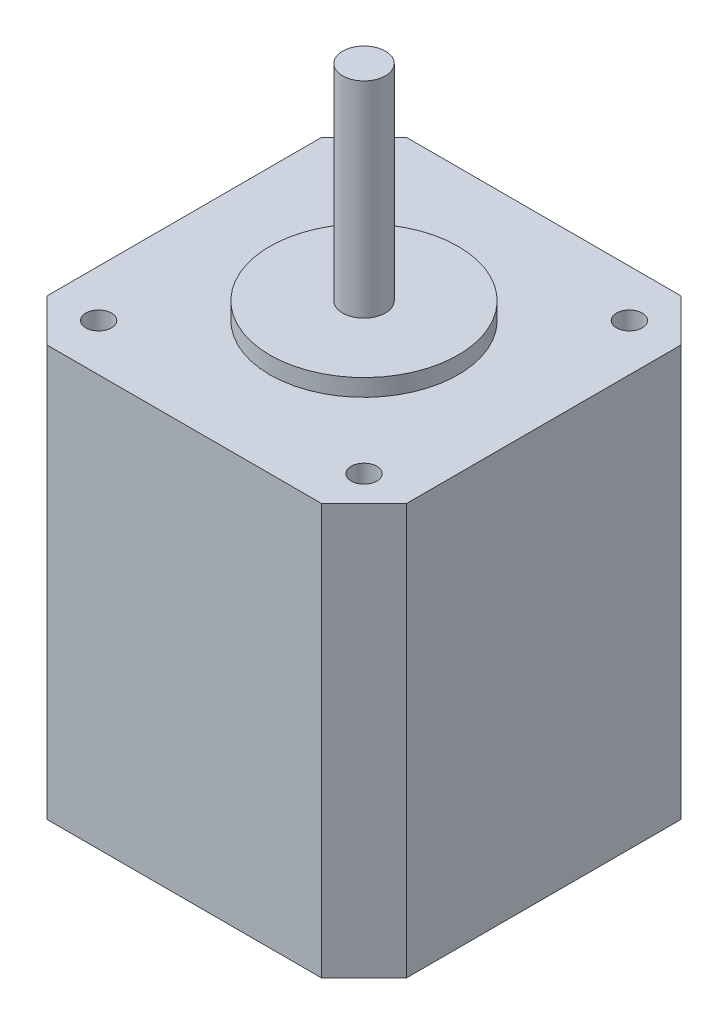
ISO-10303-21;
HEADER;
FILE_DESCRIPTION(('STEP AP214'),'2;1');
FILE_NAME('part.step','',(''),(''),'','','');
FILE_SCHEMA(('AUTOMOTIVE_DESIGN { 1 0 10303 214 1 1 1 1 }'));
ENDSEC;
DATA;
#1=APPLICATION_CONTEXT('core data for automotive mechanical design processes');
#2=APPLICATION_PROTOCOL_DEFINITION('international standard','automotive_design',2000,#1);
#3=PRODUCT_CONTEXT('',#1,'mechanical');
#4=PRODUCT('Part','Part','',(#3));
#5=PRODUCT_RELATED_PRODUCT_CATEGORY('part','',(#4));
#6=PRODUCT_DEFINITION_FORMATION('','',#4);
#7=PRODUCT_DEFINITION_CONTEXT('part definition',#1,'design');
#8=PRODUCT_DEFINITION('design','',#6,#7);
#9=PRODUCT_DEFINITION_SHAPE('','',#8);
#10=(LENGTH_UNIT() NAMED_UNIT(*) SI_UNIT(.MILLI.,.METRE.));
#11=(NAMED_UNIT(*) PLANE_ANGLE_UNIT() SI_UNIT($,.RADIAN.));
#12=(NAMED_UNIT(*) SI_UNIT($,.STERADIAN.) SOLID_ANGLE_UNIT());
#13=UNCERTAINTY_MEASURE_WITH_UNIT(LENGTH_MEASURE(1.E-05),#10,'distance_accuracy_value','');
#14=(GEOMETRIC_REPRESENTATION_CONTEXT(3) GLOBAL_UNCERTAINTY_ASSIGNED_CONTEXT((#13)) GLOBAL_UNIT_ASSIGNED_CONTEXT((#10,
#11,#12)) REPRESENTATION_CONTEXT('',''));
#15=CARTESIAN_POINT('',(0.,0.,0.));
#16=DIRECTION('',(0.,0.,1.));
#17=DIRECTION('',(1.,0.,0.));
#18=AXIS2_PLACEMENT_3D('',#15,#16,#17);
#19=CARTESIAN_POINT('',(0.,48.,0.));
#20=DIRECTION('',(1.,0.,0.));
#21=DIRECTION('',(0.,0.,-1.));
#22=AXIS2_PLACEMENT_3D('',#19,#20,#21);
#23=PLANE('',#22);
#24=DIRECTION('',(0.,0.,1.));
#25=VECTOR('',#24,1.);
#26=CARTESIAN_POINT('',(0.,48.,0.));
#27=LINE('',#26,#25);
#28=CARTESIAN_POINT('',(0.,48.,-37.0502525316942));
#29=VERTEX_POINT('',#28);
#30=CARTESIAN_POINT('',(0.,48.,-4.94974746830583));
#31=VERTEX_POINT('',#30);
#32=EDGE_CURVE('E120',#29,#31,#27,.T.);
#33=ORIENTED_EDGE('',*,*,#32,.F.);
#34=DIRECTION('',(0.,1.,0.));
#35=VECTOR('',#34,1.);
#36=CARTESIAN_POINT('',(0.,0.,-37.0502525316942));
#37=LINE('',#36,#35);
#38=CARTESIAN_POINT('',(0.,0.,-37.0502525316942));
#39=VERTEX_POINT('',#38);
#40=EDGE_CURVE('E177',#39,#29,#37,.T.);
#41=ORIENTED_EDGE('',*,*,#40,.F.);
#42=DIRECTION('',(0.,0.,1.));
#43=VECTOR('',#42,1.);
#44=CARTESIAN_POINT('',(0.,0.,0.));
#45=LINE('',#44,#43);
#46=CARTESIAN_POINT('',(0.,0.,-4.94974746830583));
#47=VERTEX_POINT('',#46);
#48=EDGE_CURVE('E121',#39,#47,#45,.T.);
#49=ORIENTED_EDGE('',*,*,#48,.T.);
#50=DIRECTION('',(0.,1.,0.));
#51=VECTOR('',#50,1.);
#52=CARTESIAN_POINT('',(0.,0.,-4.94974746830583));
#53=LINE('',#52,#51);
#54=EDGE_CURVE('E165',#47,#31,#53,.T.);
#55=ORIENTED_EDGE('',*,*,#54,.T.);
#56=EDGE_LOOP('',(#33,#41,#49,#55));
#57=FACE_BOUND('',#56,.T.);
#58=ADVANCED_FACE('F32',(#57),#23,.F.);
#59=CARTESIAN_POINT('',(0.,48.,0.));
#60=DIRECTION('',(0.,0.,-1.));
#61=DIRECTION('',(-1.,0.,0.));
#62=AXIS2_PLACEMENT_3D('',#59,#60,#61);
#63=PLANE('',#62);
#64=DIRECTION('',(1.,0.,0.));
#65=VECTOR('',#64,1.);
#66=CARTESIAN_POINT('',(0.,0.,0.));
#67=LINE('',#66,#65);
#68=CARTESIAN_POINT('',(4.94974746830583,0.,0.));
#69=VERTEX_POINT('',#68);
#70=CARTESIAN_POINT('',(37.0502525316942,0.,0.));
#71=VERTEX_POINT('',#70);
#72=EDGE_CURVE('E118',#69,#71,#67,.T.);
#73=ORIENTED_EDGE('',*,*,#72,.T.);
#74=DIRECTION('',(0.,1.,0.));
#75=VECTOR('',#74,1.);
#76=CARTESIAN_POINT('',(37.0502525316942,0.,0.));
#77=LINE('',#76,#75);
#78=CARTESIAN_POINT('',(37.0502525316942,48.,0.));
#79=VERTEX_POINT('',#78);
#80=EDGE_CURVE('E48',#71,#79,#77,.T.);
#81=ORIENTED_EDGE('',*,*,#80,.T.);
#82=DIRECTION('',(1.,0.,0.));
#83=VECTOR('',#82,1.);
#84=CARTESIAN_POINT('',(0.,48.,0.));
#85=LINE('',#84,#83);
#86=CARTESIAN_POINT('',(4.94974746830583,48.,0.));
#87=VERTEX_POINT('',#86);
#88=EDGE_CURVE('E131',#87,#79,#85,.T.);
#89=ORIENTED_EDGE('',*,*,#88,.F.);
#90=DIRECTION('',(0.,1.,0.));
#91=VECTOR('',#90,1.);
#92=CARTESIAN_POINT('',(4.94974746830583,0.,0.));
#93=LINE('',#92,#91);
#94=EDGE_CURVE('E168',#69,#87,#93,.T.);
#95=ORIENTED_EDGE('',*,*,#94,.F.);
#96=EDGE_LOOP('',(#73,#81,#89,#95));
#97=FACE_BOUND('',#96,.T.);
#98=ADVANCED_FACE('F196',(#97),#63,.F.);
#99=CARTESIAN_POINT('',(42.,48.,0.));
#100=DIRECTION('',(-1.,0.,0.));
#101=DIRECTION('',(0.,0.,1.));
#102=AXIS2_PLACEMENT_3D('',#99,#100,#101);
#103=PLANE('',#102);
#104=DIRECTION('',(0.,0.,-1.));
#105=VECTOR('',#104,1.);
#106=CARTESIAN_POINT('',(42.,0.,0.));
#107=LINE('',#106,#105);
#108=CARTESIAN_POINT('',(42.,0.,-4.94974746830583));
#109=VERTEX_POINT('',#108);
#110=CARTESIAN_POINT('',(42.,0.,-37.0502525316942));
#111=VERTEX_POINT('',#110);
#112=EDGE_CURVE('E110',#109,#111,#107,.T.);
#113=ORIENTED_EDGE('',*,*,#112,.T.);
#114=DIRECTION('',(0.,1.,0.));
#115=VECTOR('',#114,1.);
#116=CARTESIAN_POINT('',(42.,0.,-37.0502525316942));
#117=LINE('',#116,#115);
#118=CARTESIAN_POINT('',(42.,48.,-37.0502525316942));
#119=VERTEX_POINT('',#118);
#120=EDGE_CURVE('E56',#111,#119,#117,.T.);
#121=ORIENTED_EDGE('',*,*,#120,.T.);
#122=DIRECTION('',(0.,0.,-1.));
#123=VECTOR('',#122,1.);
#124=CARTESIAN_POINT('',(42.,48.,0.));
#125=LINE('',#124,#123);
#126=CARTESIAN_POINT('',(42.,48.,-4.94974746830583));
#127=VERTEX_POINT('',#126);
#128=EDGE_CURVE('E112',#127,#119,#125,.T.);
#129=ORIENTED_EDGE('',*,*,#128,.F.);
#130=DIRECTION('',(0.,1.,0.));
#131=VECTOR('',#130,1.);
#132=CARTESIAN_POINT('',(42.,0.,-4.94974746830583));
#133=LINE('',#132,#131);
#134=EDGE_CURVE('E98',#109,#127,#133,.T.);
#135=ORIENTED_EDGE('',*,*,#134,.F.);
#136=EDGE_LOOP('',(#113,#121,#129,#135));
#137=FACE_BOUND('',#136,.T.);
#138=ADVANCED_FACE('F109',(#137),#103,.F.);
#139=CARTESIAN_POINT('',(0.,48.,-42.));
#140=DIRECTION('',(0.,0.,1.));
#141=DIRECTION('',(1.,0.,0.));
#142=AXIS2_PLACEMENT_3D('',#139,#140,#141);
#143=PLANE('',#142);
#144=DIRECTION('',(-1.,0.,0.));
#145=VECTOR('',#144,1.);
#146=CARTESIAN_POINT('',(0.,0.,-42.));
#147=LINE('',#146,#145);
#148=CARTESIAN_POINT('',(37.0502525316942,0.,-42.));
#149=VERTEX_POINT('',#148);
#150=CARTESIAN_POINT('',(4.94974746830584,0.,-42.));
#151=VERTEX_POINT('',#150);
#152=EDGE_CURVE('E35',#149,#151,#147,.T.);
#153=ORIENTED_EDGE('',*,*,#152,.T.);
#154=DIRECTION('',(0.,1.,0.));
#155=VECTOR('',#154,1.);
#156=CARTESIAN_POINT('',(4.94974746830583,0.,-42.));
#157=LINE('',#156,#155);
#158=CARTESIAN_POINT('',(4.94974746830583,48.,-42.));
#159=VERTEX_POINT('',#158);
#160=EDGE_CURVE('E179',#151,#159,#157,.T.);
#161=ORIENTED_EDGE('',*,*,#160,.T.);
#162=DIRECTION('',(-1.,0.,0.));
#163=VECTOR('',#162,1.);
#164=CARTESIAN_POINT('',(0.,48.,-42.));
#165=LINE('',#164,#163);
#166=CARTESIAN_POINT('',(37.0502525316942,48.,-42.));
#167=VERTEX_POINT('',#166);
#168=EDGE_CURVE('E127',#167,#159,#165,.T.);
#169=ORIENTED_EDGE('',*,*,#168,.F.);
#170=DIRECTION('',(0.,1.,0.));
#171=VECTOR('',#170,1.);
#172=CARTESIAN_POINT('',(37.0502525316942,0.,-42.));
#173=LINE('',#172,#171);
#174=EDGE_CURVE('E187',#149,#167,#173,.T.);
#175=ORIENTED_EDGE('',*,*,#174,.F.);
#176=EDGE_LOOP('',(#153,#161,#169,#175));
#177=FACE_BOUND('',#176,.T.);
#178=ADVANCED_FACE('F210',(#177),#143,.F.);
#179=CARTESIAN_POINT('',(0.,48.,0.));
#180=DIRECTION('',(0.,-1.,0.));
#181=DIRECTION('',(0.,0.,-1.));
#182=AXIS2_PLACEMENT_3D('',#179,#180,#181);
#183=PLANE('',#182);
#184=CARTESIAN_POINT('',(36.5,48.,-36.5));
#185=DIRECTION('',(0.,1.,0.));
#186=DIRECTION('',(0.,0.,-1.));
#187=AXIS2_PLACEMENT_3D('',#184,#185,#186);
#188=CIRCLE('',#187,1.5);
#189=CARTESIAN_POINT('',(36.5,48.,-38.));
#190=VERTEX_POINT('',#189);
#191=EDGE_CURVE('E157',#190,#190,#188,.T.);
#192=ORIENTED_EDGE('',*,*,#191,.F.);
#193=EDGE_LOOP('',(#192));
#194=FACE_BOUND('',#193,.T.);
#195=CARTESIAN_POINT('',(5.49999999999998,48.,-5.50000000000004));
#196=DIRECTION('',(0.,1.,0.));
#197=DIRECTION('',(0.,0.,-1.));
#198=AXIS2_PLACEMENT_3D('',#195,#196,#197);
#199=CIRCLE('',#198,1.5);
#200=CARTESIAN_POINT('',(5.49999999999998,48.,-7.00000000000005));
#201=VERTEX_POINT('',#200);
#202=EDGE_CURVE('E150',#201,#201,#199,.T.);
#203=ORIENTED_EDGE('',*,*,#202,.F.);
#204=EDGE_LOOP('',(#203));
#205=FACE_BOUND('',#204,.T.);
#206=CARTESIAN_POINT('',(5.49999999999999,48.,-36.5));
#207=DIRECTION('',(0.,1.,0.));
#208=DIRECTION('',(0.,0.,1.));
#209=AXIS2_PLACEMENT_3D('',#206,#207,#208);
#210=CIRCLE('',#209,1.50000000000001);
#211=CARTESIAN_POINT('',(5.49999999999999,48.,-35.));
#212=VERTEX_POINT('',#211);
#213=EDGE_CURVE('E162',#212,#212,#210,.T.);
#214=ORIENTED_EDGE('',*,*,#213,.F.);
#215=EDGE_LOOP('',(#214));
#216=FACE_BOUND('',#215,.T.);
#217=CARTESIAN_POINT('',(36.5,48.,-5.5));
#218=DIRECTION('',(0.,1.,0.));
#219=DIRECTION('',(0.,0.,1.));
#220=AXIS2_PLACEMENT_3D('',#217,#218,#219);
#221=CIRCLE('',#220,1.5);
#222=CARTESIAN_POINT('',(36.5,48.,-4.));
#223=VERTEX_POINT('',#222);
#224=EDGE_CURVE('E144',#223,#223,#221,.T.);
#225=ORIENTED_EDGE('',*,*,#224,.F.);
#226=EDGE_LOOP('',(#225));
#227=FACE_BOUND('',#226,.T.);
#228=CARTESIAN_POINT('',(21.,48.,-21.));
#229=DIRECTION('',(0.,1.,0.));
#230=DIRECTION('',(0.,0.,1.));
#231=AXIS2_PLACEMENT_3D('',#228,#229,#230);
#232=CIRCLE('',#231,11.);
#233=CARTESIAN_POINT('',(21.,48.,-10.));
#234=VERTEX_POINT('',#233);
#235=EDGE_CURVE('E40',#234,#234,#232,.T.);
#236=ORIENTED_EDGE('',*,*,#235,.F.);
#237=EDGE_LOOP('',(#236));
#238=FACE_BOUND('',#237,.T.);
#239=ORIENTED_EDGE('',*,*,#168,.T.);
#240=DIRECTION('',(0.707106781186548,0.,-0.707106781186547));
#241=VECTOR('',#240,1.);
#242=CARTESIAN_POINT('',(0.,48.,-37.0502525316942));
#243=LINE('',#242,#241);
#244=EDGE_CURVE('E184',#29,#159,#243,.T.);
#245=ORIENTED_EDGE('',*,*,#244,.F.);
#246=ORIENTED_EDGE('',*,*,#32,.T.);
#247=DIRECTION('',(-0.707106781186548,0.,-0.707106781186548));
#248=VECTOR('',#247,1.);
#249=CARTESIAN_POINT('',(0.,48.,-4.94974746830583));
#250=LINE('',#249,#248);
#251=EDGE_CURVE('E173',#87,#31,#250,.T.);
#252=ORIENTED_EDGE('',*,*,#251,.F.);
#253=ORIENTED_EDGE('',*,*,#88,.T.);
#254=DIRECTION('',(-0.707106781186547,0.,0.707106781186548));
#255=VECTOR('',#254,1.);
#256=CARTESIAN_POINT('',(37.0502525316942,48.,0.));
#257=LINE('',#256,#255);
#258=EDGE_CURVE('E104',#127,#79,#257,.T.);
#259=ORIENTED_EDGE('',*,*,#258,.F.);
#260=ORIENTED_EDGE('',*,*,#128,.T.);
#261=DIRECTION('',(0.707106781186547,0.,0.707106781186547));
#262=VECTOR('',#261,1.);
#263=CARTESIAN_POINT('',(37.0502525316942,48.,-42.));
#264=LINE('',#263,#262);
#265=EDGE_CURVE('E183',#167,#119,#264,.T.);
#266=ORIENTED_EDGE('',*,*,#265,.F.);
#267=EDGE_LOOP('',(#239,#245,#246,#252,#253,#259,#260,#266));
#268=FACE_BOUND('',#267,.T.);
#269=ADVANCED_FACE('F199',(#194,#205,#216,#227,#238,#268),#183,.F.);
#270=CARTESIAN_POINT('',(0.,0.,0.));
#271=DIRECTION('',(0.,-1.,0.));
#272=DIRECTION('',(0.,0.,-1.));
#273=AXIS2_PLACEMENT_3D('',#270,#271,#272);
#274=PLANE('',#273);
#275=DIRECTION('',(0.707106781186548,0.,-0.707106781186547));
#276=VECTOR('',#275,1.);
#277=CARTESIAN_POINT('',(0.,0.,-37.0502525316942));
#278=LINE('',#277,#276);
#279=EDGE_CURVE('E180',#39,#151,#278,.T.);
#280=ORIENTED_EDGE('',*,*,#279,.T.);
#281=ORIENTED_EDGE('',*,*,#152,.F.);
#282=DIRECTION('',(0.707106781186547,0.,0.707106781186547));
#283=VECTOR('',#282,1.);
#284=CARTESIAN_POINT('',(37.0502525316942,0.,-42.));
#285=LINE('',#284,#283);
#286=EDGE_CURVE('E117',#149,#111,#285,.T.);
#287=ORIENTED_EDGE('',*,*,#286,.T.);
#288=ORIENTED_EDGE('',*,*,#112,.F.);
#289=DIRECTION('',(-0.707106781186547,0.,0.707106781186548));
#290=VECTOR('',#289,1.);
#291=CARTESIAN_POINT('',(37.0502525316942,0.,0.));
#292=LINE('',#291,#290);
#293=EDGE_CURVE('E95',#109,#71,#292,.T.);
#294=ORIENTED_EDGE('',*,*,#293,.T.);
#295=ORIENTED_EDGE('',*,*,#72,.F.);
#296=DIRECTION('',(-0.707106781186548,0.,-0.707106781186548));
#297=VECTOR('',#296,1.);
#298=CARTESIAN_POINT('',(0.,0.,-4.94974746830583));
#299=LINE('',#298,#297);
#300=EDGE_CURVE('E170',#69,#47,#299,.T.);
#301=ORIENTED_EDGE('',*,*,#300,.T.);
#302=ORIENTED_EDGE('',*,*,#48,.F.);
#303=EDGE_LOOP('',(#280,#281,#287,#288,#294,#295,#301,#302));
#304=FACE_BOUND('',#303,.T.);
#305=ADVANCED_FACE('F115',(#304),#274,.T.);
#306=CARTESIAN_POINT('',(21.,50.,-21.));
#307=DIRECTION('',(0.,-1.,0.));
#308=DIRECTION('',(0.,0.,-1.));
#309=AXIS2_PLACEMENT_3D('',#306,#307,#308);
#310=CYLINDRICAL_SURFACE('',#309,11.);
#311=CARTESIAN_POINT('',(21.,50.,-21.));
#312=DIRECTION('',(0.,1.,0.));
#313=DIRECTION('',(0.,0.,1.));
#314=AXIS2_PLACEMENT_3D('',#311,#312,#313);
#315=CIRCLE('',#314,11.);
#316=CARTESIAN_POINT('',(21.,50.,-10.));
#317=VERTEX_POINT('',#316);
#318=EDGE_CURVE('E126',#317,#317,#315,.T.);
#319=ORIENTED_EDGE('',*,*,#318,.F.);
#320=EDGE_LOOP('',(#319));
#321=FACE_BOUND('',#320,.T.);
#322=ORIENTED_EDGE('',*,*,#235,.T.);
#323=EDGE_LOOP('',(#322));
#324=FACE_BOUND('',#323,.T.);
#325=ADVANCED_FACE('F236',(#321,#324),#310,.T.);
#326=CARTESIAN_POINT('',(21.,50.,-21.));
#327=DIRECTION('',(0.,1.,0.));
#328=DIRECTION('',(0.,0.,1.));
#329=AXIS2_PLACEMENT_3D('',#326,#327,#328);
#330=PLANE('',#329);
#331=CARTESIAN_POINT('',(21.,50.,-21.));
#332=DIRECTION('',(0.,1.,0.));
#333=DIRECTION('',(0.,0.,1.));
#334=AXIS2_PLACEMENT_3D('',#331,#332,#333);
#335=CIRCLE('',#334,2.5);
#336=CARTESIAN_POINT('',(21.,50.,-18.5));
#337=VERTEX_POINT('',#336);
#338=EDGE_CURVE('E11',#337,#337,#335,.T.);
#339=ORIENTED_EDGE('',*,*,#338,.F.);
#340=EDGE_LOOP('',(#339));
#341=FACE_BOUND('',#340,.T.);
#342=ORIENTED_EDGE('',*,*,#318,.T.);
#343=EDGE_LOOP('',(#342));
#344=FACE_BOUND('',#343,.T.);
#345=ADVANCED_FACE('F242',(#341,#344),#330,.T.);
#346=CARTESIAN_POINT('',(21.,74.,-21.));
#347=DIRECTION('',(0.,-1.,0.));
#348=DIRECTION('',(0.,0.,-1.));
#349=AXIS2_PLACEMENT_3D('',#346,#347,#348);
#350=CYLINDRICAL_SURFACE('',#349,2.5);
#351=CARTESIAN_POINT('',(21.,74.,-21.));
#352=DIRECTION('',(0.,1.,0.));
#353=DIRECTION('',(0.,0.,1.));
#354=AXIS2_PLACEMENT_3D('',#351,#352,#353);
#355=CIRCLE('',#354,2.5);
#356=CARTESIAN_POINT('',(21.,74.,-18.5));
#357=VERTEX_POINT('',#356);
#358=EDGE_CURVE('E139',#357,#357,#355,.T.);
#359=ORIENTED_EDGE('',*,*,#358,.F.);
#360=EDGE_LOOP('',(#359));
#361=FACE_BOUND('',#360,.T.);
#362=ORIENTED_EDGE('',*,*,#338,.T.);
#363=EDGE_LOOP('',(#362));
#364=FACE_BOUND('',#363,.T.);
#365=ADVANCED_FACE('F246',(#361,#364),#350,.T.);
#366=CARTESIAN_POINT('',(21.,74.,-21.));
#367=DIRECTION('',(0.,1.,0.));
#368=DIRECTION('',(0.,0.,1.));
#369=AXIS2_PLACEMENT_3D('',#366,#367,#368);
#370=PLANE('',#369);
#371=ORIENTED_EDGE('',*,*,#358,.T.);
#372=EDGE_LOOP('',(#371));
#373=FACE_BOUND('',#372,.T.);
#374=ADVANCED_FACE('F250',(#373),#370,.T.);
#375=CARTESIAN_POINT('',(36.5,43.5,-5.5));
#376=DIRECTION('',(0.,1.,0.));
#377=DIRECTION('',(0.,0.,1.));
#378=AXIS2_PLACEMENT_3D('',#375,#376,#377);
#379=CYLINDRICAL_SURFACE('',#378,1.5);
#380=CARTESIAN_POINT('',(36.5,43.5,-5.5));
#381=DIRECTION('',(0.,1.,0.));
#382=DIRECTION('',(0.,0.,1.));
#383=AXIS2_PLACEMENT_3D('',#380,#381,#382);
#384=CIRCLE('',#383,1.5);
#385=CARTESIAN_POINT('',(36.5,43.5,-4.));
#386=VERTEX_POINT('',#385);
#387=EDGE_CURVE('E143',#386,#386,#384,.T.);
#388=ORIENTED_EDGE('',*,*,#387,.F.);
#389=EDGE_LOOP('',(#388));
#390=FACE_BOUND('',#389,.T.);
#391=ORIENTED_EDGE('',*,*,#224,.T.);
#392=EDGE_LOOP('',(#391));
#393=FACE_BOUND('',#392,.T.);
#394=ADVANCED_FACE('F254',(#390,#393),#379,.F.);
#395=CARTESIAN_POINT('',(36.5,43.5,-5.5));
#396=DIRECTION('',(0.,1.,0.));
#397=DIRECTION('',(0.,0.,1.));
#398=AXIS2_PLACEMENT_3D('',#395,#396,#397);
#399=PLANE('',#398);
#400=ORIENTED_EDGE('',*,*,#387,.T.);
#401=EDGE_LOOP('',(#400));
#402=FACE_BOUND('',#401,.T.);
#403=ADVANCED_FACE('F258',(#402),#399,.T.);
#404=CARTESIAN_POINT('',(5.49999999999999,43.5,-36.5));
#405=DIRECTION('',(0.,1.,0.));
#406=DIRECTION('',(0.,0.,1.));
#407=AXIS2_PLACEMENT_3D('',#404,#405,#406);
#408=CYLINDRICAL_SURFACE('',#407,1.50000000000001);
#409=CARTESIAN_POINT('',(5.49999999999999,43.5,-36.5));
#410=DIRECTION('',(0.,1.,0.));
#411=DIRECTION('',(0.,0.,1.));
#412=AXIS2_PLACEMENT_3D('',#409,#410,#411);
#413=CIRCLE('',#412,1.50000000000001);
#414=CARTESIAN_POINT('',(5.49999999999999,43.5,-35.));
#415=VERTEX_POINT('',#414);
#416=EDGE_CURVE('E154',#415,#415,#413,.T.);
#417=ORIENTED_EDGE('',*,*,#416,.F.);
#418=EDGE_LOOP('',(#417));
#419=FACE_BOUND('',#418,.T.);
#420=ORIENTED_EDGE('',*,*,#213,.T.);
#421=EDGE_LOOP('',(#420));
#422=FACE_BOUND('',#421,.T.);
#423=ADVANCED_FACE('F262',(#419,#422),#408,.F.);
#424=CARTESIAN_POINT('',(5.49999999999999,43.5,-36.5));
#425=DIRECTION('',(0.,1.,0.));
#426=DIRECTION('',(0.,0.,1.));
#427=AXIS2_PLACEMENT_3D('',#424,#425,#426);
#428=PLANE('',#427);
#429=ORIENTED_EDGE('',*,*,#416,.T.);
#430=EDGE_LOOP('',(#429));
#431=FACE_BOUND('',#430,.T.);
#432=ADVANCED_FACE('F268',(#431),#428,.T.);
#433=CARTESIAN_POINT('',(5.49999999999998,43.5,-5.50000000000004));
#434=DIRECTION('',(0.,1.,0.));
#435=DIRECTION('',(0.,0.,1.));
#436=AXIS2_PLACEMENT_3D('',#433,#434,#435);
#437=CYLINDRICAL_SURFACE('',#436,1.5);
#438=CARTESIAN_POINT('',(5.49999999999998,43.5,-5.50000000000004));
#439=DIRECTION('',(0.,1.,0.));
#440=DIRECTION('',(0.,0.,-1.));
#441=AXIS2_PLACEMENT_3D('',#438,#439,#440);
#442=CIRCLE('',#441,1.5);
#443=CARTESIAN_POINT('',(5.49999999999998,43.5,-7.00000000000005));
#444=VERTEX_POINT('',#443);
#445=EDGE_CURVE('E153',#444,#444,#442,.T.);
#446=ORIENTED_EDGE('',*,*,#445,.F.);
#447=EDGE_LOOP('',(#446));
#448=FACE_BOUND('',#447,.T.);
#449=ORIENTED_EDGE('',*,*,#202,.T.);
#450=EDGE_LOOP('',(#449));
#451=FACE_BOUND('',#450,.T.);
#452=ADVANCED_FACE('F264',(#448,#451),#437,.F.);
#453=CARTESIAN_POINT('',(5.49999999999998,43.5,-5.50000000000004));
#454=DIRECTION('',(0.,-1.,0.));
#455=DIRECTION('',(0.,0.,-1.));
#456=AXIS2_PLACEMENT_3D('',#453,#454,#455);
#457=PLANE('',#456);
#458=ORIENTED_EDGE('',*,*,#445,.T.);
#459=EDGE_LOOP('',(#458));
#460=FACE_BOUND('',#459,.T.);
#461=ADVANCED_FACE('F267',(#460),#457,.F.);
#462=CARTESIAN_POINT('',(36.5,43.5,-36.5));
#463=DIRECTION('',(0.,1.,0.));
#464=DIRECTION('',(0.,0.,1.));
#465=AXIS2_PLACEMENT_3D('',#462,#463,#464);
#466=CYLINDRICAL_SURFACE('',#465,1.5);
#467=CARTESIAN_POINT('',(36.5,43.5,-36.5));
#468=DIRECTION('',(0.,1.,0.));
#469=DIRECTION('',(0.,0.,-1.));
#470=AXIS2_PLACEMENT_3D('',#467,#468,#469);
#471=CIRCLE('',#470,1.5);
#472=CARTESIAN_POINT('',(36.5,43.5,-38.));
#473=VERTEX_POINT('',#472);
#474=EDGE_CURVE('E147',#473,#473,#471,.T.);
#475=ORIENTED_EDGE('',*,*,#474,.F.);
#476=EDGE_LOOP('',(#475));
#477=FACE_BOUND('',#476,.T.);
#478=ORIENTED_EDGE('',*,*,#191,.T.);
#479=EDGE_LOOP('',(#478));
#480=FACE_BOUND('',#479,.T.);
#481=ADVANCED_FACE('F272',(#477,#480),#466,.F.);
#482=CARTESIAN_POINT('',(36.5,43.5,-36.5));
#483=DIRECTION('',(0.,-1.,0.));
#484=DIRECTION('',(0.,0.,-1.));
#485=AXIS2_PLACEMENT_3D('',#482,#483,#484);
#486=PLANE('',#485);
#487=ORIENTED_EDGE('',*,*,#474,.T.);
#488=EDGE_LOOP('',(#487));
#489=FACE_BOUND('',#488,.T.);
#490=ADVANCED_FACE('F276',(#489),#486,.F.);
#491=CARTESIAN_POINT('',(0.,0.,-4.94974746830583));
#492=DIRECTION('',(0.707106781186547,0.,-0.707106781186547));
#493=DIRECTION('',(-0.707106781186548,0.,-0.707106781186548));
#494=AXIS2_PLACEMENT_3D('',#491,#492,#493);
#495=PLANE('',#494);
#496=ORIENTED_EDGE('',*,*,#251,.T.);
#497=ORIENTED_EDGE('',*,*,#54,.F.);
#498=ORIENTED_EDGE('',*,*,#300,.F.);
#499=ORIENTED_EDGE('',*,*,#94,.T.);
#500=EDGE_LOOP('',(#496,#497,#498,#499));
#501=FACE_BOUND('',#500,.T.);
#502=ADVANCED_FACE('F203',(#501),#495,.F.);
#503=CARTESIAN_POINT('',(37.0502525316942,0.,0.));
#504=DIRECTION('',(-0.707106781186548,0.,-0.707106781186547));
#505=DIRECTION('',(-0.707106781186547,0.,0.707106781186548));
#506=AXIS2_PLACEMENT_3D('',#503,#504,#505);
#507=PLANE('',#506);
#508=ORIENTED_EDGE('',*,*,#258,.T.);
#509=ORIENTED_EDGE('',*,*,#80,.F.);
#510=ORIENTED_EDGE('',*,*,#293,.F.);
#511=ORIENTED_EDGE('',*,*,#134,.T.);
#512=EDGE_LOOP('',(#508,#509,#510,#511));
#513=FACE_BOUND('',#512,.T.);
#514=ADVANCED_FACE('F97',(#513),#507,.F.);
#515=CARTESIAN_POINT('',(37.0502525316942,0.,-42.));
#516=DIRECTION('',(-0.707106781186548,0.,0.707106781186548));
#517=DIRECTION('',(0.707106781186548,0.,0.707106781186548));
#518=AXIS2_PLACEMENT_3D('',#515,#516,#517);
#519=PLANE('',#518);
#520=ORIENTED_EDGE('',*,*,#265,.T.);
#521=ORIENTED_EDGE('',*,*,#120,.F.);
#522=ORIENTED_EDGE('',*,*,#286,.F.);
#523=ORIENTED_EDGE('',*,*,#174,.T.);
#524=EDGE_LOOP('',(#520,#521,#522,#523));
#525=FACE_BOUND('',#524,.T.);
#526=ADVANCED_FACE('F213',(#525),#519,.F.);
#527=CARTESIAN_POINT('',(0.,0.,-37.0502525316942));
#528=DIRECTION('',(0.707106781186547,0.,0.707106781186548));
#529=DIRECTION('',(0.707106781186548,0.,-0.707106781186547));
#530=AXIS2_PLACEMENT_3D('',#527,#528,#529);
#531=PLANE('',#530);
#532=ORIENTED_EDGE('',*,*,#244,.T.);
#533=ORIENTED_EDGE('',*,*,#160,.F.);
#534=ORIENTED_EDGE('',*,*,#279,.F.);
#535=ORIENTED_EDGE('',*,*,#40,.T.);
#536=EDGE_LOOP('',(#532,#533,#534,#535));
#537=FACE_BOUND('',#536,.T.);
#538=ADVANCED_FACE('F214',(#537),#531,.F.);
#539=CLOSED_SHELL('',(#58,#98,#138,#178,#269,#305,#325,#345,#365,#374,#394,#403,#423,#432,#452,
#461,#481,#490,#502,#514,#526,#538));
#540=MANIFOLD_SOLID_BREP('B2',#539);
#541=ADVANCED_BREP_SHAPE_REPRESENTATION('',(#18,#540),#14);
#542=SHAPE_DEFINITION_REPRESENTATION(#9,#541);
ENDSEC;
END-ISO-10303-21;
